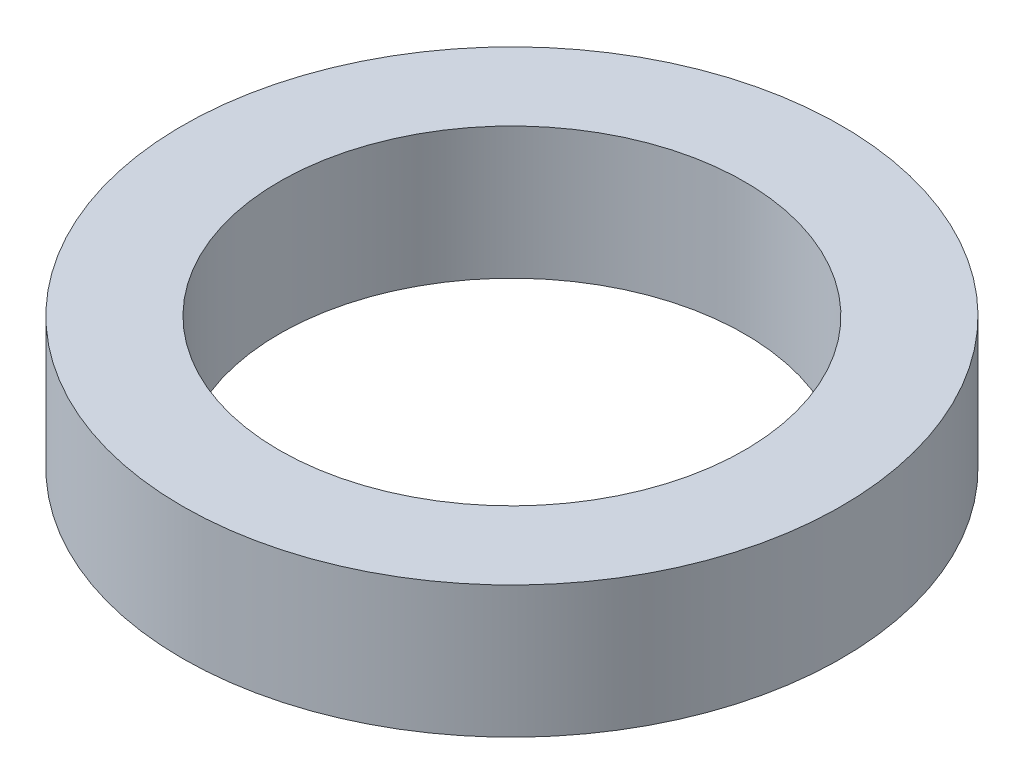
ISO-10303-21;
HEADER;
FILE_DESCRIPTION(('STEP AP214'),'2;1');
FILE_NAME('part.step','',(''),(''),'','','');
FILE_SCHEMA(('AUTOMOTIVE_DESIGN { 1 0 10303 214 1 1 1 1 }'));
ENDSEC;
DATA;
#1=APPLICATION_CONTEXT('core data for automotive mechanical design processes');
#2=APPLICATION_PROTOCOL_DEFINITION('international standard','automotive_design',2000,#1);
#3=PRODUCT_CONTEXT('',#1,'mechanical');
#4=PRODUCT('Part','Part','',(#3));
#5=PRODUCT_RELATED_PRODUCT_CATEGORY('part','',(#4));
#6=PRODUCT_DEFINITION_FORMATION('','',#4);
#7=PRODUCT_DEFINITION_CONTEXT('part definition',#1,'design');
#8=PRODUCT_DEFINITION('design','',#6,#7);
#9=PRODUCT_DEFINITION_SHAPE('','',#8);
#10=(LENGTH_UNIT() NAMED_UNIT(*) SI_UNIT(.MILLI.,.METRE.));
#11=(NAMED_UNIT(*) PLANE_ANGLE_UNIT() SI_UNIT($,.RADIAN.));
#12=(NAMED_UNIT(*) SI_UNIT($,.STERADIAN.) SOLID_ANGLE_UNIT());
#13=UNCERTAINTY_MEASURE_WITH_UNIT(LENGTH_MEASURE(1.E-05),#10,'distance_accuracy_value','');
#14=(GEOMETRIC_REPRESENTATION_CONTEXT(3) GLOBAL_UNCERTAINTY_ASSIGNED_CONTEXT((#13)) GLOBAL_UNIT_ASSIGNED_CONTEXT((#10,
#11,#12)) REPRESENTATION_CONTEXT('',''));
#15=CARTESIAN_POINT('',(0.,0.,0.));
#16=DIRECTION('',(0.,0.,1.));
#17=DIRECTION('',(1.,0.,0.));
#18=AXIS2_PLACEMENT_3D('',#15,#16,#17);
#19=CARTESIAN_POINT('',(0.,17.,0.));
#20=DIRECTION('',(0.,1.,0.));
#21=DIRECTION('',(0.,0.,1.));
#22=AXIS2_PLACEMENT_3D('',#19,#20,#21);
#23=PLANE('',#22);
#24=CARTESIAN_POINT('',(0.,17.,0.));
#25=DIRECTION('',(0.,1.,0.));
#26=DIRECTION('',(0.,0.,1.));
#27=AXIS2_PLACEMENT_3D('',#24,#25,#26);
#28=CIRCLE('',#27,42.5);
#29=CARTESIAN_POINT('',(0.,17.,42.5));
#30=VERTEX_POINT('',#29);
#31=EDGE_CURVE('E10',#30,#30,#28,.T.);
#32=ORIENTED_EDGE('',*,*,#31,.T.);
#33=EDGE_LOOP('',(#32));
#34=FACE_BOUND('',#33,.T.);
#35=CARTESIAN_POINT('',(0.,17.,0.));
#36=DIRECTION('',(0.,1.,0.));
#37=DIRECTION('',(0.,0.,1.));
#38=AXIS2_PLACEMENT_3D('',#35,#36,#37);
#39=CIRCLE('',#38,30.);
#40=CARTESIAN_POINT('',(0.,17.,30.));
#41=VERTEX_POINT('',#40);
#42=EDGE_CURVE('E45',#41,#41,#39,.T.);
#43=ORIENTED_EDGE('',*,*,#42,.F.);
#44=EDGE_LOOP('',(#43));
#45=FACE_BOUND('',#44,.T.);
#46=ADVANCED_FACE('F34',(#34,#45),#23,.T.);
#47=CARTESIAN_POINT('',(0.,0.,0.));
#48=DIRECTION('',(0.,1.,0.));
#49=DIRECTION('',(0.,0.,1.));
#50=AXIS2_PLACEMENT_3D('',#47,#48,#49);
#51=PLANE('',#50);
#52=CARTESIAN_POINT('',(0.,0.,0.));
#53=DIRECTION('',(0.,1.,0.));
#54=DIRECTION('',(0.,0.,1.));
#55=AXIS2_PLACEMENT_3D('',#52,#53,#54);
#56=CIRCLE('',#55,42.5);
#57=CARTESIAN_POINT('',(0.,0.,42.5));
#58=VERTEX_POINT('',#57);
#59=EDGE_CURVE('E38',#58,#58,#56,.T.);
#60=ORIENTED_EDGE('',*,*,#59,.F.);
#61=EDGE_LOOP('',(#60));
#62=FACE_BOUND('',#61,.T.);
#63=CARTESIAN_POINT('',(0.,0.,0.));
#64=DIRECTION('',(0.,1.,0.));
#65=DIRECTION('',(0.,0.,1.));
#66=AXIS2_PLACEMENT_3D('',#63,#64,#65);
#67=CIRCLE('',#66,30.);
#68=CARTESIAN_POINT('',(0.,0.,30.));
#69=VERTEX_POINT('',#68);
#70=EDGE_CURVE('E47',#69,#69,#67,.T.);
#71=ORIENTED_EDGE('',*,*,#70,.T.);
#72=EDGE_LOOP('',(#71));
#73=FACE_BOUND('',#72,.T.);
#74=ADVANCED_FACE('F57',(#62,#73),#51,.F.);
#75=CARTESIAN_POINT('',(0.,17.,0.));
#76=DIRECTION('',(0.,-1.,0.));
#77=DIRECTION('',(0.,0.,-1.));
#78=AXIS2_PLACEMENT_3D('',#75,#76,#77);
#79=CYLINDRICAL_SURFACE('',#78,42.5);
#80=ORIENTED_EDGE('',*,*,#31,.F.);
#81=EDGE_LOOP('',(#80));
#82=FACE_BOUND('',#81,.T.);
#83=ORIENTED_EDGE('',*,*,#59,.T.);
#84=EDGE_LOOP('',(#83));
#85=FACE_BOUND('',#84,.T.);
#86=ADVANCED_FACE('F36',(#82,#85),#79,.T.);
#87=CARTESIAN_POINT('',(0.,17.,0.));
#88=DIRECTION('',(0.,-1.,0.));
#89=DIRECTION('',(0.,0.,-1.));
#90=AXIS2_PLACEMENT_3D('',#87,#88,#89);
#91=CYLINDRICAL_SURFACE('',#90,30.);
#92=ORIENTED_EDGE('',*,*,#42,.T.);
#93=EDGE_LOOP('',(#92));
#94=FACE_BOUND('',#93,.T.);
#95=ORIENTED_EDGE('',*,*,#70,.F.);
#96=EDGE_LOOP('',(#95));
#97=FACE_BOUND('',#96,.T.);
#98=ADVANCED_FACE('F53',(#94,#97),#91,.F.);
#99=CLOSED_SHELL('',(#46,#74,#86,#98));
#100=MANIFOLD_SOLID_BREP('B2',#99);
#101=ADVANCED_BREP_SHAPE_REPRESENTATION('',(#18,#100),#14);
#102=SHAPE_DEFINITION_REPRESENTATION(#9,#101);
ENDSEC;
END-ISO-10303-21;
